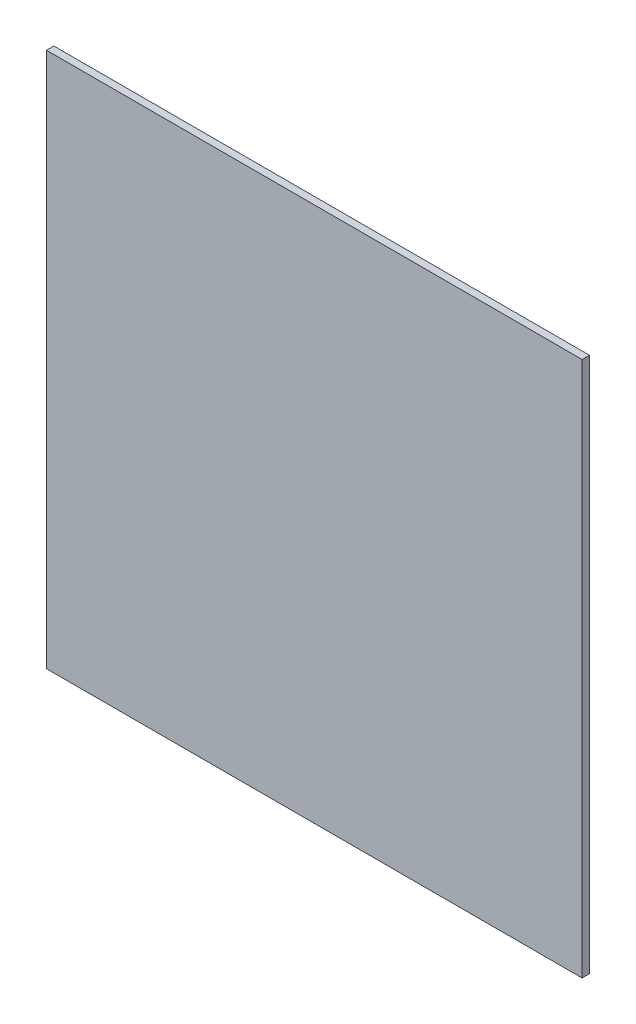
ISO-10303-21;
HEADER;
FILE_DESCRIPTION(('STEP AP214'),'2;1');
FILE_NAME('part.step','',(''),(''),'','','');
FILE_SCHEMA(('AUTOMOTIVE_DESIGN { 1 0 10303 214 1 1 1 1 }'));
ENDSEC;
DATA;
#1=APPLICATION_CONTEXT('core data for automotive mechanical design processes');
#2=APPLICATION_PROTOCOL_DEFINITION('international standard','automotive_design',2000,#1);
#3=PRODUCT_CONTEXT('',#1,'mechanical');
#4=PRODUCT('Part','Part','',(#3));
#5=PRODUCT_RELATED_PRODUCT_CATEGORY('part','',(#4));
#6=PRODUCT_DEFINITION_FORMATION('','',#4);
#7=PRODUCT_DEFINITION_CONTEXT('part definition',#1,'design');
#8=PRODUCT_DEFINITION('design','',#6,#7);
#9=PRODUCT_DEFINITION_SHAPE('','',#8);
#10=(LENGTH_UNIT() NAMED_UNIT(*) SI_UNIT(.MILLI.,.METRE.));
#11=(NAMED_UNIT(*) PLANE_ANGLE_UNIT() SI_UNIT($,.RADIAN.));
#12=(NAMED_UNIT(*) SI_UNIT($,.STERADIAN.) SOLID_ANGLE_UNIT());
#13=UNCERTAINTY_MEASURE_WITH_UNIT(LENGTH_MEASURE(1.E-05),#10,'distance_accuracy_value','');
#14=(GEOMETRIC_REPRESENTATION_CONTEXT(3) GLOBAL_UNCERTAINTY_ASSIGNED_CONTEXT((#13)) GLOBAL_UNIT_ASSIGNED_CONTEXT((#10,
#11,#12)) REPRESENTATION_CONTEXT('',''));
#15=CARTESIAN_POINT('',(0.,0.,0.));
#16=DIRECTION('',(0.,0.,1.));
#17=DIRECTION('',(1.,0.,0.));
#18=AXIS2_PLACEMENT_3D('',#15,#16,#17);
#19=CARTESIAN_POINT('',(0.,0.,2.75));
#20=DIRECTION('',(1.,0.,0.));
#21=DIRECTION('',(0.,0.,-1.));
#22=AXIS2_PLACEMENT_3D('',#19,#20,#21);
#23=PLANE('',#22);
#24=DIRECTION('',(0.,-1.,0.));
#25=VECTOR('',#24,1.);
#26=CARTESIAN_POINT('',(0.,0.,0.));
#27=LINE('',#26,#25);
#28=CARTESIAN_POINT('',(0.,200.,0.));
#29=VERTEX_POINT('',#28);
#30=CARTESIAN_POINT('',(0.,0.,0.));
#31=VERTEX_POINT('',#30);
#32=EDGE_CURVE('E107',#29,#31,#27,.T.);
#33=ORIENTED_EDGE('',*,*,#32,.T.);
#34=DIRECTION('',(0.,0.,-1.));
#35=VECTOR('',#34,1.);
#36=CARTESIAN_POINT('',(0.,0.,2.75));
#37=LINE('',#36,#35);
#38=CARTESIAN_POINT('',(0.,0.,2.75));
#39=VERTEX_POINT('',#38);
#40=EDGE_CURVE('E11',#39,#31,#37,.T.);
#41=ORIENTED_EDGE('',*,*,#40,.F.);
#42=DIRECTION('',(0.,-1.,0.));
#43=VECTOR('',#42,1.);
#44=CARTESIAN_POINT('',(0.,0.,2.75));
#45=LINE('',#44,#43);
#46=CARTESIAN_POINT('',(0.,200.,2.75));
#47=VERTEX_POINT('',#46);
#48=EDGE_CURVE('E91',#47,#39,#45,.T.);
#49=ORIENTED_EDGE('',*,*,#48,.F.);
#50=DIRECTION('',(0.,0.,-1.));
#51=VECTOR('',#50,1.);
#52=CARTESIAN_POINT('',(0.,200.,2.75));
#53=LINE('',#52,#51);
#54=EDGE_CURVE('E103',#47,#29,#53,.T.);
#55=ORIENTED_EDGE('',*,*,#54,.T.);
#56=EDGE_LOOP('',(#33,#41,#49,#55));
#57=FACE_BOUND('',#56,.T.);
#58=ADVANCED_FACE('F39',(#57),#23,.F.);
#59=CARTESIAN_POINT('',(0.,0.,2.75));
#60=DIRECTION('',(0.,1.,0.));
#61=DIRECTION('',(0.,0.,1.));
#62=AXIS2_PLACEMENT_3D('',#59,#60,#61);
#63=PLANE('',#62);
#64=DIRECTION('',(1.,0.,0.));
#65=VECTOR('',#64,1.);
#66=CARTESIAN_POINT('',(0.,0.,0.));
#67=LINE('',#66,#65);
#68=CARTESIAN_POINT('',(200.,0.,0.));
#69=VERTEX_POINT('',#68);
#70=EDGE_CURVE('E96',#31,#69,#67,.T.);
#71=ORIENTED_EDGE('',*,*,#70,.T.);
#72=DIRECTION('',(0.,0.,-1.));
#73=VECTOR('',#72,1.);
#74=CARTESIAN_POINT('',(200.,0.,2.75));
#75=LINE('',#74,#73);
#76=CARTESIAN_POINT('',(200.,0.,2.75));
#77=VERTEX_POINT('',#76);
#78=EDGE_CURVE('E48',#77,#69,#75,.T.);
#79=ORIENTED_EDGE('',*,*,#78,.F.);
#80=DIRECTION('',(1.,0.,0.));
#81=VECTOR('',#80,1.);
#82=CARTESIAN_POINT('',(0.,0.,2.75));
#83=LINE('',#82,#81);
#84=EDGE_CURVE('E86',#39,#77,#83,.T.);
#85=ORIENTED_EDGE('',*,*,#84,.F.);
#86=ORIENTED_EDGE('',*,*,#40,.T.);
#87=EDGE_LOOP('',(#71,#79,#85,#86));
#88=FACE_BOUND('',#87,.T.);
#89=ADVANCED_FACE('F95',(#88),#63,.F.);
#90=CARTESIAN_POINT('',(200.,0.,2.75));
#91=DIRECTION('',(-1.,0.,0.));
#92=DIRECTION('',(0.,0.,1.));
#93=AXIS2_PLACEMENT_3D('',#90,#91,#92);
#94=PLANE('',#93);
#95=DIRECTION('',(0.,1.,0.));
#96=VECTOR('',#95,1.);
#97=CARTESIAN_POINT('',(200.,0.,0.));
#98=LINE('',#97,#96);
#99=CARTESIAN_POINT('',(200.,200.,0.));
#100=VERTEX_POINT('',#99);
#101=EDGE_CURVE('E73',#69,#100,#98,.T.);
#102=ORIENTED_EDGE('',*,*,#101,.T.);
#103=DIRECTION('',(0.,0.,-1.));
#104=VECTOR('',#103,1.);
#105=CARTESIAN_POINT('',(200.,200.,2.75));
#106=LINE('',#105,#104);
#107=CARTESIAN_POINT('',(200.,200.,2.75));
#108=VERTEX_POINT('',#107);
#109=EDGE_CURVE('E98',#108,#100,#106,.T.);
#110=ORIENTED_EDGE('',*,*,#109,.F.);
#111=DIRECTION('',(0.,1.,0.));
#112=VECTOR('',#111,1.);
#113=CARTESIAN_POINT('',(200.,0.,2.75));
#114=LINE('',#113,#112);
#115=EDGE_CURVE('E89',#77,#108,#114,.T.);
#116=ORIENTED_EDGE('',*,*,#115,.F.);
#117=ORIENTED_EDGE('',*,*,#78,.T.);
#118=EDGE_LOOP('',(#102,#110,#116,#117));
#119=FACE_BOUND('',#118,.T.);
#120=ADVANCED_FACE('F99',(#119),#94,.F.);
#121=CARTESIAN_POINT('',(0.,200.,2.75));
#122=DIRECTION('',(0.,-1.,0.));
#123=DIRECTION('',(0.,0.,-1.));
#124=AXIS2_PLACEMENT_3D('',#121,#122,#123);
#125=PLANE('',#124);
#126=DIRECTION('',(-1.,0.,0.));
#127=VECTOR('',#126,1.);
#128=CARTESIAN_POINT('',(0.,200.,0.));
#129=LINE('',#128,#127);
#130=EDGE_CURVE('E79',#100,#29,#129,.T.);
#131=ORIENTED_EDGE('',*,*,#130,.T.);
#132=ORIENTED_EDGE('',*,*,#54,.F.);
#133=DIRECTION('',(-1.,0.,0.));
#134=VECTOR('',#133,1.);
#135=CARTESIAN_POINT('',(0.,200.,2.75));
#136=LINE('',#135,#134);
#137=EDGE_CURVE('E56',#108,#47,#136,.T.);
#138=ORIENTED_EDGE('',*,*,#137,.F.);
#139=ORIENTED_EDGE('',*,*,#109,.T.);
#140=EDGE_LOOP('',(#131,#132,#138,#139));
#141=FACE_BOUND('',#140,.T.);
#142=ADVANCED_FACE('F120',(#141),#125,.F.);
#143=CARTESIAN_POINT('',(0.,0.,2.75));
#144=DIRECTION('',(0.,0.,-1.));
#145=DIRECTION('',(-1.,0.,0.));
#146=AXIS2_PLACEMENT_3D('',#143,#144,#145);
#147=PLANE('',#146);
#148=ORIENTED_EDGE('',*,*,#48,.T.);
#149=ORIENTED_EDGE('',*,*,#84,.T.);
#150=ORIENTED_EDGE('',*,*,#115,.T.);
#151=ORIENTED_EDGE('',*,*,#137,.T.);
#152=EDGE_LOOP('',(#148,#149,#150,#151));
#153=FACE_BOUND('',#152,.T.);
#154=ADVANCED_FACE('F87',(#153),#147,.F.);
#155=CARTESIAN_POINT('',(0.,0.,0.));
#156=DIRECTION('',(0.,0.,-1.));
#157=DIRECTION('',(-1.,0.,0.));
#158=AXIS2_PLACEMENT_3D('',#155,#156,#157);
#159=PLANE('',#158);
#160=ORIENTED_EDGE('',*,*,#32,.F.);
#161=ORIENTED_EDGE('',*,*,#130,.F.);
#162=ORIENTED_EDGE('',*,*,#101,.F.);
#163=ORIENTED_EDGE('',*,*,#70,.F.);
#164=EDGE_LOOP('',(#160,#161,#162,#163));
#165=FACE_BOUND('',#164,.T.);
#166=ADVANCED_FACE('F123',(#165),#159,.T.);
#167=CLOSED_SHELL('',(#58,#89,#120,#142,#154,#166));
#168=MANIFOLD_SOLID_BREP('B2',#167);
#169=ADVANCED_BREP_SHAPE_REPRESENTATION('',(#18,#168),#14);
#170=SHAPE_DEFINITION_REPRESENTATION(#9,#169);
ENDSEC;
END-ISO-10303-21;
